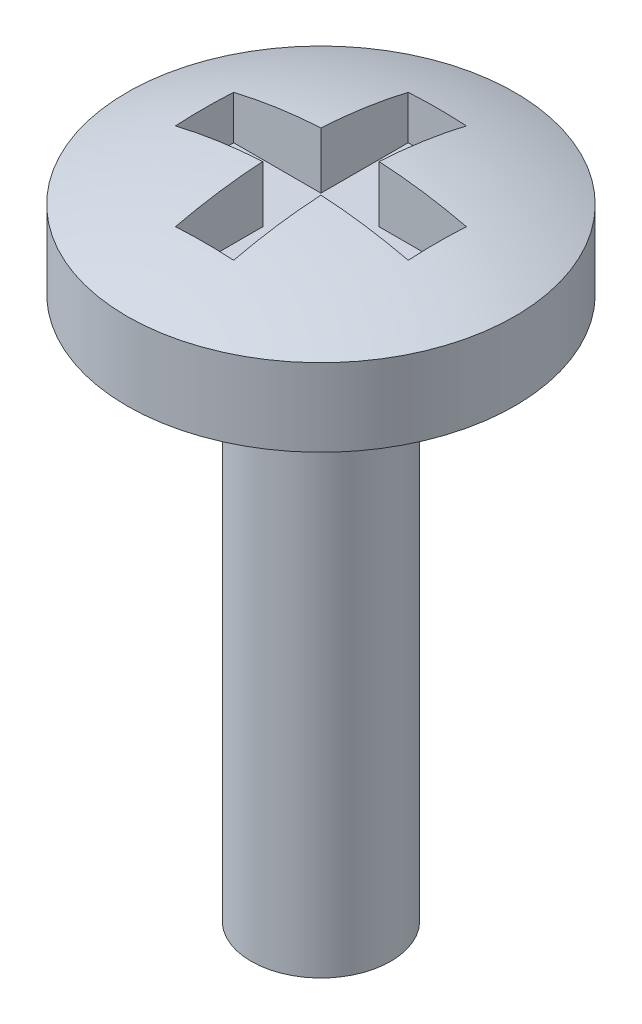
ISO-10303-21;
HEADER;
FILE_DESCRIPTION(('STEP AP214'),'2;1');
FILE_NAME('part.step','',(''),(''),'','','');
FILE_SCHEMA(('AUTOMOTIVE_DESIGN { 1 0 10303 214 1 1 1 1 }'));
ENDSEC;
DATA;
#1=APPLICATION_CONTEXT('core data for automotive mechanical design processes');
#2=APPLICATION_PROTOCOL_DEFINITION('international standard','automotive_design',2000,#1);
#3=PRODUCT_CONTEXT('',#1,'mechanical');
#4=PRODUCT('Part','Part','',(#3));
#5=PRODUCT_RELATED_PRODUCT_CATEGORY('part','',(#4));
#6=PRODUCT_DEFINITION_FORMATION('','',#4);
#7=PRODUCT_DEFINITION_CONTEXT('part definition',#1,'design');
#8=PRODUCT_DEFINITION('design','',#6,#7);
#9=PRODUCT_DEFINITION_SHAPE('','',#8);
#10=(LENGTH_UNIT() NAMED_UNIT(*) SI_UNIT(.MILLI.,.METRE.));
#11=(NAMED_UNIT(*) PLANE_ANGLE_UNIT() SI_UNIT($,.RADIAN.));
#12=(NAMED_UNIT(*) SI_UNIT($,.STERADIAN.) SOLID_ANGLE_UNIT());
#13=UNCERTAINTY_MEASURE_WITH_UNIT(LENGTH_MEASURE(1.E-05),#10,'distance_accuracy_value','');
#14=(GEOMETRIC_REPRESENTATION_CONTEXT(3) GLOBAL_UNCERTAINTY_ASSIGNED_CONTEXT((#13)) GLOBAL_UNIT_ASSIGNED_CONTEXT((#10,
#11,#12)) REPRESENTATION_CONTEXT('',''));
#15=CARTESIAN_POINT('',(0.,0.,0.));
#16=DIRECTION('',(0.,0.,1.));
#17=DIRECTION('',(1.,0.,0.));
#18=AXIS2_PLACEMENT_3D('',#15,#16,#17);
#19=CARTESIAN_POINT('',(0.,7.,0.));
#20=DIRECTION('',(0.,-1.,0.));
#21=DIRECTION('',(0.,0.,-1.));
#22=AXIS2_PLACEMENT_3D('',#19,#20,#21);
#23=CYLINDRICAL_SURFACE('',#22,0.9);
#24=CARTESIAN_POINT('',(0.,7.,0.));
#25=DIRECTION('',(0.,1.,0.));
#26=DIRECTION('',(0.,0.,1.));
#27=AXIS2_PLACEMENT_3D('',#24,#25,#26);
#28=CIRCLE('',#27,0.9);
#29=CARTESIAN_POINT('',(0.,7.,0.9));
#30=VERTEX_POINT('',#29);
#31=EDGE_CURVE('E197',#30,#30,#28,.T.);
#32=ORIENTED_EDGE('',*,*,#31,.F.);
#33=EDGE_LOOP('',(#32));
#34=FACE_BOUND('',#33,.T.);
#35=CARTESIAN_POINT('',(0.,0.,0.));
#36=DIRECTION('',(0.,1.,0.));
#37=DIRECTION('',(0.,0.,1.));
#38=AXIS2_PLACEMENT_3D('',#35,#36,#37);
#39=CIRCLE('',#38,0.9);
#40=CARTESIAN_POINT('',(0.,0.,0.9));
#41=VERTEX_POINT('',#40);
#42=EDGE_CURVE('E201',#41,#41,#39,.T.);
#43=ORIENTED_EDGE('',*,*,#42,.T.);
#44=EDGE_LOOP('',(#43));
#45=FACE_BOUND('',#44,.T.);
#46=ADVANCED_FACE('F34',(#34,#45),#23,.T.);
#47=CARTESIAN_POINT('',(0.,0.,0.));
#48=DIRECTION('',(0.,1.,0.));
#49=DIRECTION('',(0.,0.,1.));
#50=AXIS2_PLACEMENT_3D('',#47,#48,#49);
#51=PLANE('',#50);
#52=ORIENTED_EDGE('',*,*,#42,.F.);
#53=EDGE_LOOP('',(#52));
#54=FACE_BOUND('',#53,.T.);
#55=ADVANCED_FACE('F275',(#54),#51,.F.);
#56=CARTESIAN_POINT('',(0.,8.,0.));
#57=DIRECTION('',(0.,-1.,0.));
#58=DIRECTION('',(0.,0.,-1.));
#59=AXIS2_PLACEMENT_3D('',#56,#57,#58);
#60=CYLINDRICAL_SURFACE('',#59,2.5);
#61=CARTESIAN_POINT('',(0.,8.,0.));
#62=DIRECTION('',(0.,1.,0.));
#63=DIRECTION('',(0.,0.,1.));
#64=AXIS2_PLACEMENT_3D('',#61,#62,#63);
#65=CIRCLE('',#64,2.5);
#66=CARTESIAN_POINT('',(0.,8.,2.5));
#67=VERTEX_POINT('',#66);
#68=EDGE_CURVE('E196',#67,#67,#65,.T.);
#69=ORIENTED_EDGE('',*,*,#68,.F.);
#70=EDGE_LOOP('',(#69));
#71=FACE_BOUND('',#70,.T.);
#72=CARTESIAN_POINT('',(0.,7.,0.));
#73=DIRECTION('',(0.,1.,0.));
#74=DIRECTION('',(0.,0.,1.));
#75=AXIS2_PLACEMENT_3D('',#72,#73,#74);
#76=CIRCLE('',#75,2.5);
#77=CARTESIAN_POINT('',(0.,7.,2.5));
#78=VERTEX_POINT('',#77);
#79=EDGE_CURVE('E166',#78,#78,#76,.T.);
#80=ORIENTED_EDGE('',*,*,#79,.T.);
#81=EDGE_LOOP('',(#80));
#82=FACE_BOUND('',#81,.T.);
#83=ADVANCED_FACE('F280',(#71,#82),#60,.T.);
#84=CARTESIAN_POINT('',(0.,2.00000000000001,0.));
#85=DIRECTION('',(0.,0.,1.));
#86=DIRECTION('',(1.,0.,0.));
#87=AXIS2_PLACEMENT_3D('',#84,#85,#86);
#88=SPHERICAL_SURFACE('',#87,6.49999999999999);
#89=CARTESIAN_POINT('',(0.,2.00000000000001,0.375));
#90=DIRECTION('',(0.,0.,1.));
#91=DIRECTION('',(1.,0.,0.));
#92=AXIS2_PLACEMENT_3D('',#89,#90,#91);
#93=CIRCLE('',#92,6.4891736762087);
#94=CARTESIAN_POINT('',(-1.5,8.31342814958719,0.375));
#95=VERTEX_POINT('',#94);
#96=CARTESIAN_POINT('',(-0.375,8.47832925992497,0.375));
#97=VERTEX_POINT('',#96);
#98=EDGE_CURVE('E11',#95,#97,#93,.F.);
#99=ORIENTED_EDGE('',*,*,#98,.F.);
#100=CARTESIAN_POINT('',(-1.5,2.00000000000001,0.));
#101=DIRECTION('',(-1.,0.,0.));
#102=DIRECTION('',(0.,0.,1.));
#103=AXIS2_PLACEMENT_3D('',#100,#101,#102);
#104=CIRCLE('',#103,6.32455532033675);
#105=CARTESIAN_POINT('',(-1.5,8.3134281495872,-0.375));
#106=VERTEX_POINT('',#105);
#107=EDGE_CURVE('E42',#106,#95,#104,.F.);
#108=ORIENTED_EDGE('',*,*,#107,.F.);
#109=CARTESIAN_POINT('',(0.,2.00000000000001,-0.375));
#110=DIRECTION('',(0.,0.,1.));
#111=DIRECTION('',(1.,0.,0.));
#112=AXIS2_PLACEMENT_3D('',#109,#110,#111);
#113=CIRCLE('',#112,6.4891736762087);
#114=CARTESIAN_POINT('',(-0.375,8.47832925992497,-0.375));
#115=VERTEX_POINT('',#114);
#116=EDGE_CURVE('E228',#106,#115,#113,.F.);
#117=ORIENTED_EDGE('',*,*,#116,.T.);
#118=CARTESIAN_POINT('',(-0.375,2.00000000000001,0.));
#119=DIRECTION('',(-1.,0.,0.));
#120=DIRECTION('',(0.,0.,1.));
#121=AXIS2_PLACEMENT_3D('',#118,#119,#120);
#122=CIRCLE('',#121,6.4891736762087);
#123=CARTESIAN_POINT('',(-0.375,8.31342814958719,-1.5));
#124=VERTEX_POINT('',#123);
#125=EDGE_CURVE('E226',#124,#115,#122,.F.);
#126=ORIENTED_EDGE('',*,*,#125,.F.);
#127=CARTESIAN_POINT('',(0.,2.00000000000001,-1.5));
#128=DIRECTION('',(0.,0.,1.));
#129=DIRECTION('',(1.,0.,0.));
#130=AXIS2_PLACEMENT_3D('',#127,#128,#129);
#131=CIRCLE('',#130,6.32455532033675);
#132=CARTESIAN_POINT('',(0.375,8.3134281495872,-1.5));
#133=VERTEX_POINT('',#132);
#134=EDGE_CURVE('E223',#124,#133,#131,.F.);
#135=ORIENTED_EDGE('',*,*,#134,.T.);
#136=CARTESIAN_POINT('',(0.375,2.00000000000001,0.));
#137=DIRECTION('',(-1.,0.,0.));
#138=DIRECTION('',(0.,0.,1.));
#139=AXIS2_PLACEMENT_3D('',#136,#137,#138);
#140=CIRCLE('',#139,6.4891736762087);
#141=CARTESIAN_POINT('',(0.375,8.47832925992497,-0.375));
#142=VERTEX_POINT('',#141);
#143=EDGE_CURVE('E220',#133,#142,#140,.F.);
#144=ORIENTED_EDGE('',*,*,#143,.T.);
#145=CARTESIAN_POINT('',(0.,2.00000000000001,-0.375));
#146=DIRECTION('',(0.,0.,1.));
#147=DIRECTION('',(1.,0.,0.));
#148=AXIS2_PLACEMENT_3D('',#145,#146,#147);
#149=CIRCLE('',#148,6.4891736762087);
#150=CARTESIAN_POINT('',(1.5,8.31342814958719,-0.375));
#151=VERTEX_POINT('',#150);
#152=EDGE_CURVE('E217',#142,#151,#149,.F.);
#153=ORIENTED_EDGE('',*,*,#152,.T.);
#154=CARTESIAN_POINT('',(1.5,2.00000000000001,0.));
#155=DIRECTION('',(-1.,0.,0.));
#156=DIRECTION('',(0.,0.,1.));
#157=AXIS2_PLACEMENT_3D('',#154,#155,#156);
#158=CIRCLE('',#157,6.32455532033675);
#159=CARTESIAN_POINT('',(1.5,8.3134281495872,0.375));
#160=VERTEX_POINT('',#159);
#161=EDGE_CURVE('E214',#151,#160,#158,.F.);
#162=ORIENTED_EDGE('',*,*,#161,.T.);
#163=CARTESIAN_POINT('',(0.,2.00000000000001,0.375));
#164=DIRECTION('',(0.,0.,1.));
#165=DIRECTION('',(1.,0.,0.));
#166=AXIS2_PLACEMENT_3D('',#163,#164,#165);
#167=CIRCLE('',#166,6.4891736762087);
#168=CARTESIAN_POINT('',(0.375,8.47832925992497,0.375));
#169=VERTEX_POINT('',#168);
#170=EDGE_CURVE('E212',#169,#160,#167,.F.);
#171=ORIENTED_EDGE('',*,*,#170,.F.);
#172=CARTESIAN_POINT('',(0.375,2.00000000000001,0.));
#173=DIRECTION('',(-1.,0.,0.));
#174=DIRECTION('',(0.,0.,1.));
#175=AXIS2_PLACEMENT_3D('',#172,#173,#174);
#176=CIRCLE('',#175,6.4891736762087);
#177=CARTESIAN_POINT('',(0.375,8.31342814958719,1.5));
#178=VERTEX_POINT('',#177);
#179=EDGE_CURVE('E209',#169,#178,#176,.F.);
#180=ORIENTED_EDGE('',*,*,#179,.T.);
#181=CARTESIAN_POINT('',(0.,2.00000000000001,1.5));
#182=DIRECTION('',(0.,0.,1.));
#183=DIRECTION('',(1.,0.,0.));
#184=AXIS2_PLACEMENT_3D('',#181,#182,#183);
#185=CIRCLE('',#184,6.32455532033675);
#186=CARTESIAN_POINT('',(-0.375,8.3134281495872,1.5));
#187=VERTEX_POINT('',#186);
#188=EDGE_CURVE('E207',#187,#178,#185,.F.);
#189=ORIENTED_EDGE('',*,*,#188,.F.);
#190=CARTESIAN_POINT('',(-0.375,2.00000000000001,0.));
#191=DIRECTION('',(-1.,0.,0.));
#192=DIRECTION('',(0.,0.,1.));
#193=AXIS2_PLACEMENT_3D('',#190,#191,#192);
#194=CIRCLE('',#193,6.4891736762087);
#195=EDGE_CURVE('E200',#97,#187,#194,.F.);
#196=ORIENTED_EDGE('',*,*,#195,.F.);
#197=EDGE_LOOP('',(#99,#108,#117,#126,#135,#144,#153,#162,#171,#180,#189,#196));
#198=FACE_BOUND('',#197,.T.);
#199=ORIENTED_EDGE('',*,*,#68,.T.);
#200=EDGE_LOOP('',(#199));
#201=FACE_BOUND('',#200,.T.);
#202=ADVANCED_FACE('F36',(#198,#201),#88,.T.);
#203=CARTESIAN_POINT('',(0.,7.,0.));
#204=DIRECTION('',(0.,1.,0.));
#205=DIRECTION('',(0.,0.,1.));
#206=AXIS2_PLACEMENT_3D('',#203,#204,#205);
#207=PLANE('',#206);
#208=ORIENTED_EDGE('',*,*,#31,.T.);
#209=EDGE_LOOP('',(#208));
#210=FACE_BOUND('',#209,.T.);
#211=ORIENTED_EDGE('',*,*,#79,.F.);
#212=EDGE_LOOP('',(#211));
#213=FACE_BOUND('',#212,.T.);
#214=ADVANCED_FACE('F289',(#210,#213),#207,.F.);
#215=CARTESIAN_POINT('',(0.,7.75,0.375));
#216=DIRECTION('',(0.,0.,1.));
#217=DIRECTION('',(1.,0.,0.));
#218=AXIS2_PLACEMENT_3D('',#215,#216,#217);
#219=PLANE('',#218);
#220=ORIENTED_EDGE('',*,*,#98,.T.);
#221=DIRECTION('',(0.,1.,0.));
#222=VECTOR('',#221,1.);
#223=CARTESIAN_POINT('',(-0.375,7.75,0.375));
#224=LINE('',#223,#222);
#225=CARTESIAN_POINT('',(-0.375,7.75,0.375));
#226=VERTEX_POINT('',#225);
#227=EDGE_CURVE('E49',#226,#97,#224,.T.);
#228=ORIENTED_EDGE('',*,*,#227,.F.);
#229=DIRECTION('',(1.,0.,0.));
#230=VECTOR('',#229,1.);
#231=CARTESIAN_POINT('',(0.,7.75,0.375));
#232=LINE('',#231,#230);
#233=CARTESIAN_POINT('',(-1.5,7.75,0.375));
#234=VERTEX_POINT('',#233);
#235=EDGE_CURVE('E123',#234,#226,#232,.T.);
#236=ORIENTED_EDGE('',*,*,#235,.F.);
#237=DIRECTION('',(0.,1.,0.));
#238=VECTOR('',#237,1.);
#239=CARTESIAN_POINT('',(-1.5,7.75,0.375));
#240=LINE('',#239,#238);
#241=EDGE_CURVE('E164',#234,#95,#240,.T.);
#242=ORIENTED_EDGE('',*,*,#241,.T.);
#243=EDGE_LOOP('',(#220,#228,#236,#242));
#244=FACE_BOUND('',#243,.T.);
#245=ADVANCED_FACE('F121',(#244),#219,.F.);
#246=CARTESIAN_POINT('',(-1.5,7.75,0.));
#247=DIRECTION('',(-1.,0.,0.));
#248=DIRECTION('',(0.,0.,1.));
#249=AXIS2_PLACEMENT_3D('',#246,#247,#248);
#250=PLANE('',#249);
#251=ORIENTED_EDGE('',*,*,#107,.T.);
#252=ORIENTED_EDGE('',*,*,#241,.F.);
#253=DIRECTION('',(0.,0.,1.));
#254=VECTOR('',#253,1.);
#255=CARTESIAN_POINT('',(-1.5,7.75,0.));
#256=LINE('',#255,#254);
#257=CARTESIAN_POINT('',(-1.5,7.75,-0.375));
#258=VERTEX_POINT('',#257);
#259=EDGE_CURVE('E128',#258,#234,#256,.T.);
#260=ORIENTED_EDGE('',*,*,#259,.F.);
#261=DIRECTION('',(0.,1.,0.));
#262=VECTOR('',#261,1.);
#263=CARTESIAN_POINT('',(-1.5,7.75,-0.375));
#264=LINE('',#263,#262);
#265=EDGE_CURVE('E167',#258,#106,#264,.T.);
#266=ORIENTED_EDGE('',*,*,#265,.T.);
#267=EDGE_LOOP('',(#251,#252,#260,#266));
#268=FACE_BOUND('',#267,.T.);
#269=ADVANCED_FACE('F236',(#268),#250,.F.);
#270=CARTESIAN_POINT('',(0.,7.75,-0.375));
#271=DIRECTION('',(0.,0.,1.));
#272=DIRECTION('',(1.,0.,0.));
#273=AXIS2_PLACEMENT_3D('',#270,#271,#272);
#274=PLANE('',#273);
#275=ORIENTED_EDGE('',*,*,#265,.F.);
#276=DIRECTION('',(1.,0.,0.));
#277=VECTOR('',#276,1.);
#278=CARTESIAN_POINT('',(0.,7.75,-0.375));
#279=LINE('',#278,#277);
#280=CARTESIAN_POINT('',(-0.375,7.75,-0.375));
#281=VERTEX_POINT('',#280);
#282=EDGE_CURVE('E161',#258,#281,#279,.T.);
#283=ORIENTED_EDGE('',*,*,#282,.T.);
#284=DIRECTION('',(0.,1.,0.));
#285=VECTOR('',#284,1.);
#286=CARTESIAN_POINT('',(-0.375,7.75,-0.375));
#287=LINE('',#286,#285);
#288=EDGE_CURVE('E169',#281,#115,#287,.T.);
#289=ORIENTED_EDGE('',*,*,#288,.T.);
#290=ORIENTED_EDGE('',*,*,#116,.F.);
#291=EDGE_LOOP('',(#275,#283,#289,#290));
#292=FACE_BOUND('',#291,.T.);
#293=ADVANCED_FACE('F234',(#292),#274,.T.);
#294=CARTESIAN_POINT('',(-0.375,7.75,0.));
#295=DIRECTION('',(-1.,0.,0.));
#296=DIRECTION('',(0.,0.,1.));
#297=AXIS2_PLACEMENT_3D('',#294,#295,#296);
#298=PLANE('',#297);
#299=ORIENTED_EDGE('',*,*,#125,.T.);
#300=ORIENTED_EDGE('',*,*,#288,.F.);
#301=DIRECTION('',(0.,0.,1.));
#302=VECTOR('',#301,1.);
#303=CARTESIAN_POINT('',(-0.375,7.75,0.));
#304=LINE('',#303,#302);
#305=CARTESIAN_POINT('',(-0.375,7.75,-1.5));
#306=VERTEX_POINT('',#305);
#307=EDGE_CURVE('E158',#306,#281,#304,.T.);
#308=ORIENTED_EDGE('',*,*,#307,.F.);
#309=DIRECTION('',(0.,1.,0.));
#310=VECTOR('',#309,1.);
#311=CARTESIAN_POINT('',(-0.375,7.75,-1.5));
#312=LINE('',#311,#310);
#313=EDGE_CURVE('E172',#306,#124,#312,.T.);
#314=ORIENTED_EDGE('',*,*,#313,.T.);
#315=EDGE_LOOP('',(#299,#300,#308,#314));
#316=FACE_BOUND('',#315,.T.);
#317=ADVANCED_FACE('F264',(#316),#298,.F.);
#318=CARTESIAN_POINT('',(0.,7.75,-1.5));
#319=DIRECTION('',(0.,0.,1.));
#320=DIRECTION('',(1.,0.,0.));
#321=AXIS2_PLACEMENT_3D('',#318,#319,#320);
#322=PLANE('',#321);
#323=ORIENTED_EDGE('',*,*,#313,.F.);
#324=DIRECTION('',(1.,0.,0.));
#325=VECTOR('',#324,1.);
#326=CARTESIAN_POINT('',(0.,7.75,-1.5));
#327=LINE('',#326,#325);
#328=CARTESIAN_POINT('',(0.375,7.75,-1.5));
#329=VERTEX_POINT('',#328);
#330=EDGE_CURVE('E156',#306,#329,#327,.T.);
#331=ORIENTED_EDGE('',*,*,#330,.T.);
#332=DIRECTION('',(0.,1.,0.));
#333=VECTOR('',#332,1.);
#334=CARTESIAN_POINT('',(0.375,7.75,-1.5));
#335=LINE('',#334,#333);
#336=EDGE_CURVE('E175',#329,#133,#335,.T.);
#337=ORIENTED_EDGE('',*,*,#336,.T.);
#338=ORIENTED_EDGE('',*,*,#134,.F.);
#339=EDGE_LOOP('',(#323,#331,#337,#338));
#340=FACE_BOUND('',#339,.T.);
#341=ADVANCED_FACE('F265',(#340),#322,.T.);
#342=CARTESIAN_POINT('',(0.375,7.75,0.));
#343=DIRECTION('',(-1.,0.,0.));
#344=DIRECTION('',(0.,0.,1.));
#345=AXIS2_PLACEMENT_3D('',#342,#343,#344);
#346=PLANE('',#345);
#347=ORIENTED_EDGE('',*,*,#336,.F.);
#348=DIRECTION('',(0.,0.,1.));
#349=VECTOR('',#348,1.);
#350=CARTESIAN_POINT('',(0.375,7.75,0.));
#351=LINE('',#350,#349);
#352=CARTESIAN_POINT('',(0.375,7.75,-0.375));
#353=VERTEX_POINT('',#352);
#354=EDGE_CURVE('E154',#329,#353,#351,.T.);
#355=ORIENTED_EDGE('',*,*,#354,.T.);
#356=DIRECTION('',(0.,1.,0.));
#357=VECTOR('',#356,1.);
#358=CARTESIAN_POINT('',(0.375,7.75,-0.375));
#359=LINE('',#358,#357);
#360=EDGE_CURVE('E178',#353,#142,#359,.T.);
#361=ORIENTED_EDGE('',*,*,#360,.T.);
#362=ORIENTED_EDGE('',*,*,#143,.F.);
#363=EDGE_LOOP('',(#347,#355,#361,#362));
#364=FACE_BOUND('',#363,.T.);
#365=ADVANCED_FACE('F258',(#364),#346,.T.);
#366=CARTESIAN_POINT('',(0.,7.75,-0.375));
#367=DIRECTION('',(0.,0.,1.));
#368=DIRECTION('',(1.,0.,0.));
#369=AXIS2_PLACEMENT_3D('',#366,#367,#368);
#370=PLANE('',#369);
#371=ORIENTED_EDGE('',*,*,#360,.F.);
#372=DIRECTION('',(1.,0.,0.));
#373=VECTOR('',#372,1.);
#374=CARTESIAN_POINT('',(0.,7.75,-0.375));
#375=LINE('',#374,#373);
#376=CARTESIAN_POINT('',(1.5,7.75,-0.375));
#377=VERTEX_POINT('',#376);
#378=EDGE_CURVE('E152',#353,#377,#375,.T.);
#379=ORIENTED_EDGE('',*,*,#378,.T.);
#380=DIRECTION('',(0.,1.,0.));
#381=VECTOR('',#380,1.);
#382=CARTESIAN_POINT('',(1.5,7.75,-0.375));
#383=LINE('',#382,#381);
#384=EDGE_CURVE('E181',#377,#151,#383,.T.);
#385=ORIENTED_EDGE('',*,*,#384,.T.);
#386=ORIENTED_EDGE('',*,*,#152,.F.);
#387=EDGE_LOOP('',(#371,#379,#385,#386));
#388=FACE_BOUND('',#387,.T.);
#389=ADVANCED_FACE('F254',(#388),#370,.T.);
#390=CARTESIAN_POINT('',(1.5,7.75,0.));
#391=DIRECTION('',(-1.,0.,0.));
#392=DIRECTION('',(0.,0.,1.));
#393=AXIS2_PLACEMENT_3D('',#390,#391,#392);
#394=PLANE('',#393);
#395=ORIENTED_EDGE('',*,*,#384,.F.);
#396=DIRECTION('',(0.,0.,1.));
#397=VECTOR('',#396,1.);
#398=CARTESIAN_POINT('',(1.5,7.75,0.));
#399=LINE('',#398,#397);
#400=CARTESIAN_POINT('',(1.5,7.75,0.375));
#401=VERTEX_POINT('',#400);
#402=EDGE_CURVE('E150',#377,#401,#399,.T.);
#403=ORIENTED_EDGE('',*,*,#402,.T.);
#404=DIRECTION('',(0.,1.,0.));
#405=VECTOR('',#404,1.);
#406=CARTESIAN_POINT('',(1.5,7.75,0.375));
#407=LINE('',#406,#405);
#408=EDGE_CURVE('E184',#401,#160,#407,.T.);
#409=ORIENTED_EDGE('',*,*,#408,.T.);
#410=ORIENTED_EDGE('',*,*,#161,.F.);
#411=EDGE_LOOP('',(#395,#403,#409,#410));
#412=FACE_BOUND('',#411,.T.);
#413=ADVANCED_FACE('F251',(#412),#394,.T.);
#414=CARTESIAN_POINT('',(0.,7.75,0.375));
#415=DIRECTION('',(0.,0.,1.));
#416=DIRECTION('',(1.,0.,0.));
#417=AXIS2_PLACEMENT_3D('',#414,#415,#416);
#418=PLANE('',#417);
#419=ORIENTED_EDGE('',*,*,#170,.T.);
#420=ORIENTED_EDGE('',*,*,#408,.F.);
#421=DIRECTION('',(1.,0.,0.));
#422=VECTOR('',#421,1.);
#423=CARTESIAN_POINT('',(0.,7.75,0.375));
#424=LINE('',#423,#422);
#425=CARTESIAN_POINT('',(0.375,7.75,0.375));
#426=VERTEX_POINT('',#425);
#427=EDGE_CURVE('E147',#426,#401,#424,.T.);
#428=ORIENTED_EDGE('',*,*,#427,.F.);
#429=DIRECTION('',(0.,1.,0.));
#430=VECTOR('',#429,1.);
#431=CARTESIAN_POINT('',(0.375,7.75,0.375));
#432=LINE('',#431,#430);
#433=EDGE_CURVE('E187',#426,#169,#432,.T.);
#434=ORIENTED_EDGE('',*,*,#433,.T.);
#435=EDGE_LOOP('',(#419,#420,#428,#434));
#436=FACE_BOUND('',#435,.T.);
#437=ADVANCED_FACE('F247',(#436),#418,.F.);
#438=CARTESIAN_POINT('',(0.375,7.75,0.));
#439=DIRECTION('',(-1.,0.,0.));
#440=DIRECTION('',(0.,0.,1.));
#441=AXIS2_PLACEMENT_3D('',#438,#439,#440);
#442=PLANE('',#441);
#443=ORIENTED_EDGE('',*,*,#433,.F.);
#444=DIRECTION('',(0.,0.,1.));
#445=VECTOR('',#444,1.);
#446=CARTESIAN_POINT('',(0.375,7.75,0.));
#447=LINE('',#446,#445);
#448=CARTESIAN_POINT('',(0.375,7.75,1.5));
#449=VERTEX_POINT('',#448);
#450=EDGE_CURVE('E145',#426,#449,#447,.T.);
#451=ORIENTED_EDGE('',*,*,#450,.T.);
#452=DIRECTION('',(0.,1.,0.));
#453=VECTOR('',#452,1.);
#454=CARTESIAN_POINT('',(0.375,7.75,1.5));
#455=LINE('',#454,#453);
#456=EDGE_CURVE('E190',#449,#178,#455,.T.);
#457=ORIENTED_EDGE('',*,*,#456,.T.);
#458=ORIENTED_EDGE('',*,*,#179,.F.);
#459=EDGE_LOOP('',(#443,#451,#457,#458));
#460=FACE_BOUND('',#459,.T.);
#461=ADVANCED_FACE('F299',(#460),#442,.T.);
#462=CARTESIAN_POINT('',(0.,7.75,1.5));
#463=DIRECTION('',(0.,0.,1.));
#464=DIRECTION('',(1.,0.,0.));
#465=AXIS2_PLACEMENT_3D('',#462,#463,#464);
#466=PLANE('',#465);
#467=ORIENTED_EDGE('',*,*,#188,.T.);
#468=ORIENTED_EDGE('',*,*,#456,.F.);
#469=DIRECTION('',(1.,0.,0.));
#470=VECTOR('',#469,1.);
#471=CARTESIAN_POINT('',(0.,7.75,1.5));
#472=LINE('',#471,#470);
#473=CARTESIAN_POINT('',(-0.375,7.75,1.5));
#474=VERTEX_POINT('',#473);
#475=EDGE_CURVE('E137',#474,#449,#472,.T.);
#476=ORIENTED_EDGE('',*,*,#475,.F.);
#477=DIRECTION('',(0.,1.,0.));
#478=VECTOR('',#477,1.);
#479=CARTESIAN_POINT('',(-0.375,7.75,1.5));
#480=LINE('',#479,#478);
#481=EDGE_CURVE('E127',#474,#187,#480,.T.);
#482=ORIENTED_EDGE('',*,*,#481,.T.);
#483=EDGE_LOOP('',(#467,#468,#476,#482));
#484=FACE_BOUND('',#483,.T.);
#485=ADVANCED_FACE('F239',(#484),#466,.F.);
#486=CARTESIAN_POINT('',(-0.375,7.75,0.));
#487=DIRECTION('',(-1.,0.,0.));
#488=DIRECTION('',(0.,0.,1.));
#489=AXIS2_PLACEMENT_3D('',#486,#487,#488);
#490=PLANE('',#489);
#491=ORIENTED_EDGE('',*,*,#195,.T.);
#492=ORIENTED_EDGE('',*,*,#481,.F.);
#493=DIRECTION('',(0.,0.,1.));
#494=VECTOR('',#493,1.);
#495=CARTESIAN_POINT('',(-0.375,7.75,0.));
#496=LINE('',#495,#494);
#497=EDGE_CURVE('E131',#226,#474,#496,.T.);
#498=ORIENTED_EDGE('',*,*,#497,.F.);
#499=ORIENTED_EDGE('',*,*,#227,.T.);
#500=EDGE_LOOP('',(#491,#492,#498,#499));
#501=FACE_BOUND('',#500,.T.);
#502=ADVANCED_FACE('F132',(#501),#490,.F.);
#503=CARTESIAN_POINT('',(0.,7.75,0.));
#504=DIRECTION('',(0.,1.,0.));
#505=DIRECTION('',(0.,0.,1.));
#506=AXIS2_PLACEMENT_3D('',#503,#504,#505);
#507=PLANE('',#506);
#508=ORIENTED_EDGE('',*,*,#235,.T.);
#509=ORIENTED_EDGE('',*,*,#497,.T.);
#510=ORIENTED_EDGE('',*,*,#475,.T.);
#511=ORIENTED_EDGE('',*,*,#450,.F.);
#512=ORIENTED_EDGE('',*,*,#427,.T.);
#513=ORIENTED_EDGE('',*,*,#402,.F.);
#514=ORIENTED_EDGE('',*,*,#378,.F.);
#515=ORIENTED_EDGE('',*,*,#354,.F.);
#516=ORIENTED_EDGE('',*,*,#330,.F.);
#517=ORIENTED_EDGE('',*,*,#307,.T.);
#518=ORIENTED_EDGE('',*,*,#282,.F.);
#519=ORIENTED_EDGE('',*,*,#259,.T.);
#520=EDGE_LOOP('',(#508,#509,#510,#511,#512,#513,#514,#515,#516,#517,#518,#519));
#521=FACE_BOUND('',#520,.T.);
#522=ADVANCED_FACE('F139',(#521),#507,.T.);
#523=CLOSED_SHELL('',(#46,#55,#83,#202,#214,#245,#269,#293,#317,#341,#365,#389,#413,#437,#461,
#485,#502,#522));
#524=MANIFOLD_SOLID_BREP('B2',#523);
#525=ADVANCED_BREP_SHAPE_REPRESENTATION('',(#18,#524),#14);
#526=SHAPE_DEFINITION_REPRESENTATION(#9,#525);
ENDSEC;
END-ISO-10303-21;
